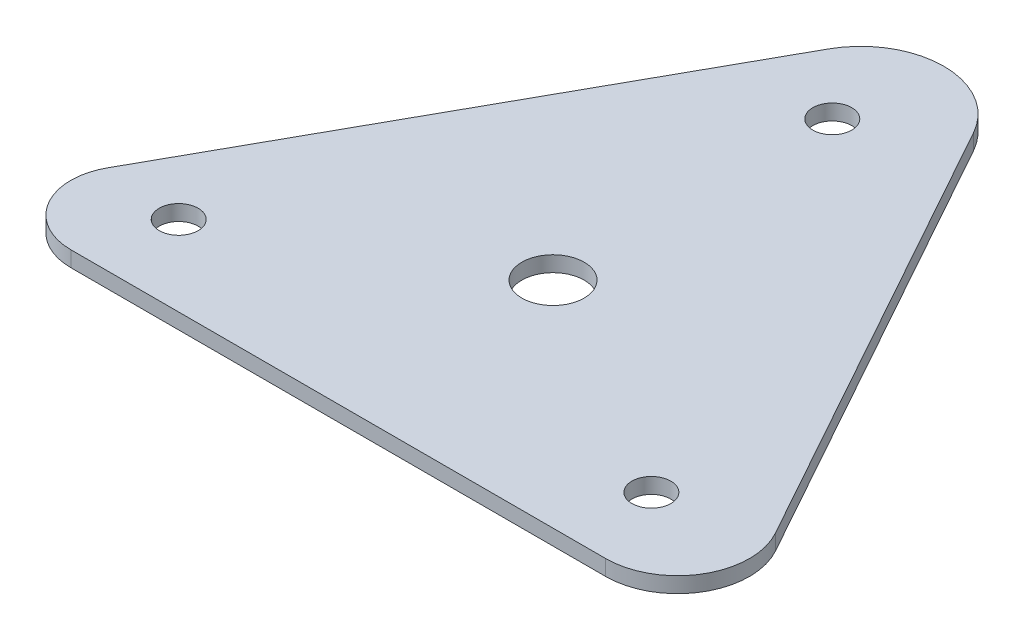
ISO-10303-21;
HEADER;
FILE_DESCRIPTION(('STEP AP214'),'2;1');
FILE_NAME('part.step','',(''),(''),'','','');
FILE_SCHEMA(('AUTOMOTIVE_DESIGN { 1 0 10303 214 1 1 1 1 }'));
ENDSEC;
DATA;
#1=APPLICATION_CONTEXT('core data for automotive mechanical design processes');
#2=APPLICATION_PROTOCOL_DEFINITION('international standard','automotive_design',2000,#1);
#3=PRODUCT_CONTEXT('',#1,'mechanical');
#4=PRODUCT('Part','Part','',(#3));
#5=PRODUCT_RELATED_PRODUCT_CATEGORY('part','',(#4));
#6=PRODUCT_DEFINITION_FORMATION('','',#4);
#7=PRODUCT_DEFINITION_CONTEXT('part definition',#1,'design');
#8=PRODUCT_DEFINITION('design','',#6,#7);
#9=PRODUCT_DEFINITION_SHAPE('','',#8);
#10=(LENGTH_UNIT() NAMED_UNIT(*) SI_UNIT(.MILLI.,.METRE.));
#11=(NAMED_UNIT(*) PLANE_ANGLE_UNIT() SI_UNIT($,.RADIAN.));
#12=(NAMED_UNIT(*) SI_UNIT($,.STERADIAN.) SOLID_ANGLE_UNIT());
#13=UNCERTAINTY_MEASURE_WITH_UNIT(LENGTH_MEASURE(1.E-05),#10,'distance_accuracy_value','');
#14=(GEOMETRIC_REPRESENTATION_CONTEXT(3) GLOBAL_UNCERTAINTY_ASSIGNED_CONTEXT((#13)) GLOBAL_UNIT_ASSIGNED_CONTEXT((#10,
#11,#12)) REPRESENTATION_CONTEXT('',''));
#15=CARTESIAN_POINT('',(0.,0.,0.));
#16=DIRECTION('',(0.,0.,1.));
#17=DIRECTION('',(1.,0.,0.));
#18=AXIS2_PLACEMENT_3D('',#15,#16,#17);
#19=CARTESIAN_POINT('',(0.,3.175,-12.2555));
#20=DIRECTION('',(0.,1.,0.));
#21=DIRECTION('',(0.,0.,1.));
#22=AXIS2_PLACEMENT_3D('',#19,#20,#21);
#23=PLANE('',#22);
#24=CARTESIAN_POINT('',(54.5591999999573,3.175,-100.779243869629));
#25=DIRECTION('',(0.,1.,0.));
#26=DIRECTION('',(0.,0.,1.));
#27=AXIS2_PLACEMENT_3D('',#24,#25,#26);
#28=CIRCLE('',#27,3.96874999999998);
#29=CARTESIAN_POINT('',(54.5591999999573,3.175,-96.8104938696286));
#30=VERTEX_POINT('',#29);
#31=EDGE_CURVE('E212',#30,#30,#28,.T.);
#32=ORIENTED_EDGE('',*,*,#31,.F.);
#33=EDGE_LOOP('',(#32));
#34=FACE_BOUND('',#33,.T.);
#35=CARTESIAN_POINT('',(5.65850908847155,3.175,-16.35798352403));
#36=DIRECTION('',(0.,1.,0.));
#37=DIRECTION('',(0.,0.,1.));
#38=AXIS2_PLACEMENT_3D('',#35,#36,#37);
#39=CIRCLE('',#38,3.96875);
#40=CARTESIAN_POINT('',(5.65850908847155,3.175,-12.38923352403));
#41=VERTEX_POINT('',#40);
#42=EDGE_CURVE('E134',#41,#41,#39,.T.);
#43=ORIENTED_EDGE('',*,*,#42,.F.);
#44=EDGE_LOOP('',(#43));
#45=FACE_BOUND('',#44,.T.);
#46=CARTESIAN_POINT('',(0.,3.175,-12.2555));
#47=DIRECTION('',(0.,1.,0.));
#48=DIRECTION('',(0.,0.,1.));
#49=AXIS2_PLACEMENT_3D('',#46,#47,#48);
#50=CIRCLE('',#49,12.2555000000001);
#51=CARTESIAN_POINT('',(-10.7131227606052,3.175,-18.2074980650374));
#52=VERTEX_POINT('',#51);
#53=CARTESIAN_POINT('',(0.,3.175,0.));
#54=VERTEX_POINT('',#53);
#55=EDGE_CURVE('E146',#52,#54,#50,.T.);
#56=ORIENTED_EDGE('',*,*,#55,.T.);
#57=DIRECTION('',(1.,0.,0.));
#58=VECTOR('',#57,1.);
#59=CARTESIAN_POINT('',(0.,3.175,0.));
#60=LINE('',#59,#58);
#61=CARTESIAN_POINT('',(109.1184,3.175,0.));
#62=VERTEX_POINT('',#61);
#63=EDGE_CURVE('E94',#54,#62,#60,.T.);
#64=ORIENTED_EDGE('',*,*,#63,.T.);
#65=CARTESIAN_POINT('',(109.1184,3.175,-14.6685));
#66=DIRECTION('',(0.,1.,0.));
#67=DIRECTION('',(0.,0.,1.));
#68=AXIS2_PLACEMENT_3D('',#65,#66,#67);
#69=CIRCLE('',#68,14.6685);
#70=CARTESIAN_POINT('',(121.940842267874,3.175,-21.7923940571169));
#71=VERTEX_POINT('',#70);
#72=EDGE_CURVE('E107',#62,#71,#69,.T.);
#73=ORIENTED_EDGE('',*,*,#72,.T.);
#74=DIRECTION('',(-0.485659341931141,0.,-0.874148158835224));
#75=VECTOR('',#74,1.);
#76=CARTESIAN_POINT('',(121.940842267874,3.175,-21.7923940571169));
#77=LINE('',#76,#75);
#78=CARTESIAN_POINT('',(71.4012856410206,3.175,-112.759573228514));
#79=VERTEX_POINT('',#78);
#80=EDGE_CURVE('E101',#71,#79,#77,.T.);
#81=ORIENTED_EDGE('',*,*,#80,.T.);
#82=CARTESIAN_POINT('',(56.6097082324124,3.175,-104.541666826972));
#83=DIRECTION('',(0.,1.,0.));
#84=DIRECTION('',(0.,0.,1.));
#85=AXIS2_PLACEMENT_3D('',#82,#83,#84);
#86=CIRCLE('',#85,16.9211331730282);
#87=CARTESIAN_POINT('',(41.8181308238042,3.175,-112.759573228514));
#88=VERTEX_POINT('',#87);
#89=EDGE_CURVE('E105',#79,#88,#86,.T.);
#90=ORIENTED_EDGE('',*,*,#89,.T.);
#91=DIRECTION('',(-0.485659341931141,0.,0.874148158835224));
#92=VECTOR('',#91,1.);
#93=CARTESIAN_POINT('',(41.8181308238042,3.175,-112.759573228514));
#94=LINE('',#93,#92);
#95=EDGE_CURVE('E57',#88,#52,#94,.T.);
#96=ORIENTED_EDGE('',*,*,#95,.T.);
#97=EDGE_LOOP('',(#56,#64,#73,#81,#90,#96));
#98=FACE_BOUND('',#97,.T.);
#99=CARTESIAN_POINT('',(102.076909088472,3.175,-16.35798352403));
#100=DIRECTION('',(0.,1.,0.));
#101=DIRECTION('',(0.,0.,1.));
#102=AXIS2_PLACEMENT_3D('',#99,#100,#101);
#103=CIRCLE('',#102,3.96874999999999);
#104=CARTESIAN_POINT('',(102.076909088472,3.175,-12.38923352403));
#105=VERTEX_POINT('',#104);
#106=EDGE_CURVE('E220',#105,#105,#103,.T.);
#107=ORIENTED_EDGE('',*,*,#106,.F.);
#108=EDGE_LOOP('',(#107));
#109=FACE_BOUND('',#108,.T.);
#110=CARTESIAN_POINT('',(54.5591999999573,3.175,-43.8121906883708));
#111=DIRECTION('',(0.,1.,0.));
#112=DIRECTION('',(0.,0.,1.));
#113=AXIS2_PLACEMENT_3D('',#110,#111,#112);
#114=CIRCLE('',#113,6.35);
#115=CARTESIAN_POINT('',(54.5591999999573,3.175,-37.4621906883708));
#116=VERTEX_POINT('',#115);
#117=EDGE_CURVE('E201',#116,#116,#114,.T.);
#118=ORIENTED_EDGE('',*,*,#117,.F.);
#119=EDGE_LOOP('',(#118));
#120=FACE_BOUND('',#119,.T.);
#121=ADVANCED_FACE('F39',(#34,#45,#98,#109,#120),#23,.T.);
#122=CARTESIAN_POINT('',(0.,0.,-12.2555));
#123=DIRECTION('',(0.,1.,0.));
#124=DIRECTION('',(0.,0.,1.));
#125=AXIS2_PLACEMENT_3D('',#122,#123,#124);
#126=PLANE('',#125);
#127=CARTESIAN_POINT('',(0.,0.,-12.2555));
#128=DIRECTION('',(0.,1.,0.));
#129=DIRECTION('',(0.,0.,1.));
#130=AXIS2_PLACEMENT_3D('',#127,#128,#129);
#131=CIRCLE('',#130,12.2555000000001);
#132=CARTESIAN_POINT('',(-10.7131227606052,0.,-18.2074980650374));
#133=VERTEX_POINT('',#132);
#134=CARTESIAN_POINT('',(0.,0.,0.));
#135=VERTEX_POINT('',#134);
#136=EDGE_CURVE('E129',#133,#135,#131,.T.);
#137=ORIENTED_EDGE('',*,*,#136,.F.);
#138=DIRECTION('',(-0.485659341931141,0.,0.874148158835224));
#139=VECTOR('',#138,1.);
#140=CARTESIAN_POINT('',(41.8181308238042,0.,-112.759573228514));
#141=LINE('',#140,#139);
#142=CARTESIAN_POINT('',(41.8181308238042,0.,-112.759573228514));
#143=VERTEX_POINT('',#142);
#144=EDGE_CURVE('E86',#143,#133,#141,.T.);
#145=ORIENTED_EDGE('',*,*,#144,.F.);
#146=CARTESIAN_POINT('',(56.6097082324124,0.,-104.541666826972));
#147=DIRECTION('',(0.,1.,0.));
#148=DIRECTION('',(0.,0.,1.));
#149=AXIS2_PLACEMENT_3D('',#146,#147,#148);
#150=CIRCLE('',#149,16.9211331730282);
#151=CARTESIAN_POINT('',(71.4012856410206,0.,-112.759573228514));
#152=VERTEX_POINT('',#151);
#153=EDGE_CURVE('E80',#152,#143,#150,.T.);
#154=ORIENTED_EDGE('',*,*,#153,.F.);
#155=DIRECTION('',(-0.485659341931141,0.,-0.874148158835224));
#156=VECTOR('',#155,1.);
#157=CARTESIAN_POINT('',(121.940842267874,0.,-21.7923940571169));
#158=LINE('',#157,#156);
#159=CARTESIAN_POINT('',(121.940842267874,0.,-21.7923940571169));
#160=VERTEX_POINT('',#159);
#161=EDGE_CURVE('E116',#160,#152,#158,.T.);
#162=ORIENTED_EDGE('',*,*,#161,.F.);
#163=CARTESIAN_POINT('',(109.1184,0.,-14.6685));
#164=DIRECTION('',(0.,1.,0.));
#165=DIRECTION('',(0.,0.,1.));
#166=AXIS2_PLACEMENT_3D('',#163,#164,#165);
#167=CIRCLE('',#166,14.6685);
#168=CARTESIAN_POINT('',(109.1184,0.,0.));
#169=VERTEX_POINT('',#168);
#170=EDGE_CURVE('E137',#169,#160,#167,.T.);
#171=ORIENTED_EDGE('',*,*,#170,.F.);
#172=DIRECTION('',(1.,0.,0.));
#173=VECTOR('',#172,1.);
#174=CARTESIAN_POINT('',(0.,0.,0.));
#175=LINE('',#174,#173);
#176=EDGE_CURVE('E133',#135,#169,#175,.T.);
#177=ORIENTED_EDGE('',*,*,#176,.F.);
#178=EDGE_LOOP('',(#137,#145,#154,#162,#171,#177));
#179=FACE_BOUND('',#178,.T.);
#180=CARTESIAN_POINT('',(5.65850908847155,0.,-16.35798352403));
#181=DIRECTION('',(0.,1.,0.));
#182=DIRECTION('',(0.,0.,1.));
#183=AXIS2_PLACEMENT_3D('',#180,#181,#182);
#184=CIRCLE('',#183,3.96875);
#185=CARTESIAN_POINT('',(5.65850908847155,0.,-12.38923352403));
#186=VERTEX_POINT('',#185);
#187=EDGE_CURVE('E224',#186,#186,#184,.T.);
#188=ORIENTED_EDGE('',*,*,#187,.T.);
#189=EDGE_LOOP('',(#188));
#190=FACE_BOUND('',#189,.T.);
#191=CARTESIAN_POINT('',(102.076909088472,0.,-16.35798352403));
#192=DIRECTION('',(0.,1.,0.));
#193=DIRECTION('',(0.,0.,1.));
#194=AXIS2_PLACEMENT_3D('',#191,#192,#193);
#195=CIRCLE('',#194,3.96874999999999);
#196=CARTESIAN_POINT('',(102.076909088472,0.,-12.38923352403));
#197=VERTEX_POINT('',#196);
#198=EDGE_CURVE('E216',#197,#197,#195,.T.);
#199=ORIENTED_EDGE('',*,*,#198,.T.);
#200=EDGE_LOOP('',(#199));
#201=FACE_BOUND('',#200,.T.);
#202=CARTESIAN_POINT('',(54.5591999999573,0.,-100.779243869629));
#203=DIRECTION('',(0.,1.,0.));
#204=DIRECTION('',(0.,0.,1.));
#205=AXIS2_PLACEMENT_3D('',#202,#203,#204);
#206=CIRCLE('',#205,3.96874999999998);
#207=CARTESIAN_POINT('',(54.5591999999573,0.,-96.8104938696286));
#208=VERTEX_POINT('',#207);
#209=EDGE_CURVE('E209',#208,#208,#206,.T.);
#210=ORIENTED_EDGE('',*,*,#209,.T.);
#211=EDGE_LOOP('',(#210));
#212=FACE_BOUND('',#211,.T.);
#213=CARTESIAN_POINT('',(54.5591999999573,0.,-43.8121906883708));
#214=DIRECTION('',(0.,1.,0.));
#215=DIRECTION('',(0.,0.,1.));
#216=AXIS2_PLACEMENT_3D('',#213,#214,#215);
#217=CIRCLE('',#216,6.35);
#218=CARTESIAN_POINT('',(54.5591999999573,0.,-37.4621906883708));
#219=VERTEX_POINT('',#218);
#220=EDGE_CURVE('E204',#219,#219,#217,.T.);
#221=ORIENTED_EDGE('',*,*,#220,.T.);
#222=EDGE_LOOP('',(#221));
#223=FACE_BOUND('',#222,.T.);
#224=ADVANCED_FACE('F159',(#179,#190,#201,#212,#223),#126,.F.);
#225=CARTESIAN_POINT('',(0.,3.175,-12.2555));
#226=DIRECTION('',(0.,-1.,0.));
#227=DIRECTION('',(0.,0.,-1.));
#228=AXIS2_PLACEMENT_3D('',#225,#226,#227);
#229=CYLINDRICAL_SURFACE('',#228,12.2555000000001);
#230=ORIENTED_EDGE('',*,*,#136,.T.);
#231=DIRECTION('',(0.,-1.,0.));
#232=VECTOR('',#231,1.);
#233=CARTESIAN_POINT('',(0.,3.175,0.));
#234=LINE('',#233,#232);
#235=EDGE_CURVE('E11',#54,#135,#234,.T.);
#236=ORIENTED_EDGE('',*,*,#235,.F.);
#237=ORIENTED_EDGE('',*,*,#55,.F.);
#238=DIRECTION('',(0.,-1.,0.));
#239=VECTOR('',#238,1.);
#240=CARTESIAN_POINT('',(-10.7131227606052,3.175,-18.2074980650374));
#241=LINE('',#240,#239);
#242=EDGE_CURVE('E125',#52,#133,#241,.T.);
#243=ORIENTED_EDGE('',*,*,#242,.T.);
#244=EDGE_LOOP('',(#230,#236,#237,#243));
#245=FACE_BOUND('',#244,.T.);
#246=ADVANCED_FACE('F41',(#245),#229,.T.);
#247=CARTESIAN_POINT('',(0.,3.175,0.));
#248=DIRECTION('',(0.,0.,-1.));
#249=DIRECTION('',(-1.,0.,0.));
#250=AXIS2_PLACEMENT_3D('',#247,#248,#249);
#251=PLANE('',#250);
#252=ORIENTED_EDGE('',*,*,#176,.T.);
#253=DIRECTION('',(0.,-1.,0.));
#254=VECTOR('',#253,1.);
#255=CARTESIAN_POINT('',(109.1184,3.175,0.));
#256=LINE('',#255,#254);
#257=EDGE_CURVE('E49',#62,#169,#256,.T.);
#258=ORIENTED_EDGE('',*,*,#257,.F.);
#259=ORIENTED_EDGE('',*,*,#63,.F.);
#260=ORIENTED_EDGE('',*,*,#235,.T.);
#261=EDGE_LOOP('',(#252,#258,#259,#260));
#262=FACE_BOUND('',#261,.T.);
#263=ADVANCED_FACE('F288',(#262),#251,.F.);
#264=CARTESIAN_POINT('',(109.1184,3.175,-14.6685));
#265=DIRECTION('',(0.,-1.,0.));
#266=DIRECTION('',(0.,0.,-1.));
#267=AXIS2_PLACEMENT_3D('',#264,#265,#266);
#268=CYLINDRICAL_SURFACE('',#267,14.6685);
#269=ORIENTED_EDGE('',*,*,#170,.T.);
#270=DIRECTION('',(0.,-1.,0.));
#271=VECTOR('',#270,1.);
#272=CARTESIAN_POINT('',(121.940842267874,3.175,-21.7923940571169));
#273=LINE('',#272,#271);
#274=EDGE_CURVE('E118',#71,#160,#273,.T.);
#275=ORIENTED_EDGE('',*,*,#274,.F.);
#276=ORIENTED_EDGE('',*,*,#72,.F.);
#277=ORIENTED_EDGE('',*,*,#257,.T.);
#278=EDGE_LOOP('',(#269,#275,#276,#277));
#279=FACE_BOUND('',#278,.T.);
#280=ADVANCED_FACE('F156',(#279),#268,.T.);
#281=CARTESIAN_POINT('',(121.940842267874,3.175,-21.7923940571169));
#282=DIRECTION('',(-0.874148158835223,0.,0.485659341931141));
#283=DIRECTION('',(0.485659341931141,0.,0.874148158835224));
#284=AXIS2_PLACEMENT_3D('',#281,#282,#283);
#285=PLANE('',#284);
#286=ORIENTED_EDGE('',*,*,#161,.T.);
#287=DIRECTION('',(0.,-1.,0.));
#288=VECTOR('',#287,1.);
#289=CARTESIAN_POINT('',(71.4012856410206,3.175,-112.759573228514));
#290=LINE('',#289,#288);
#291=EDGE_CURVE('E113',#79,#152,#290,.T.);
#292=ORIENTED_EDGE('',*,*,#291,.F.);
#293=ORIENTED_EDGE('',*,*,#80,.F.);
#294=ORIENTED_EDGE('',*,*,#274,.T.);
#295=EDGE_LOOP('',(#286,#292,#293,#294));
#296=FACE_BOUND('',#295,.T.);
#297=ADVANCED_FACE('F114',(#296),#285,.F.);
#298=CARTESIAN_POINT('',(56.6097082324124,3.175,-104.541666826972));
#299=DIRECTION('',(0.,-1.,0.));
#300=DIRECTION('',(0.,0.,-1.));
#301=AXIS2_PLACEMENT_3D('',#298,#299,#300);
#302=CYLINDRICAL_SURFACE('',#301,16.9211331730282);
#303=ORIENTED_EDGE('',*,*,#153,.T.);
#304=DIRECTION('',(0.,-1.,0.));
#305=VECTOR('',#304,1.);
#306=CARTESIAN_POINT('',(41.8181308238042,3.175,-112.759573228514));
#307=LINE('',#306,#305);
#308=EDGE_CURVE('E119',#88,#143,#307,.T.);
#309=ORIENTED_EDGE('',*,*,#308,.F.);
#310=ORIENTED_EDGE('',*,*,#89,.F.);
#311=ORIENTED_EDGE('',*,*,#291,.T.);
#312=EDGE_LOOP('',(#303,#309,#310,#311));
#313=FACE_BOUND('',#312,.T.);
#314=ADVANCED_FACE('F121',(#313),#302,.T.);
#315=CARTESIAN_POINT('',(41.8181308238042,3.175,-112.759573228514));
#316=DIRECTION('',(0.874148158835223,0.,0.485659341931141));
#317=DIRECTION('',(0.485659341931141,0.,-0.874148158835224));
#318=AXIS2_PLACEMENT_3D('',#315,#316,#317);
#319=PLANE('',#318);
#320=ORIENTED_EDGE('',*,*,#144,.T.);
#321=ORIENTED_EDGE('',*,*,#242,.F.);
#322=ORIENTED_EDGE('',*,*,#95,.F.);
#323=ORIENTED_EDGE('',*,*,#308,.T.);
#324=EDGE_LOOP('',(#320,#321,#322,#323));
#325=FACE_BOUND('',#324,.T.);
#326=ADVANCED_FACE('F164',(#325),#319,.F.);
#327=CARTESIAN_POINT('',(5.65850908847155,3.175,-16.35798352403));
#328=DIRECTION('',(0.,-1.,0.));
#329=DIRECTION('',(0.,0.,-1.));
#330=AXIS2_PLACEMENT_3D('',#327,#328,#329);
#331=CYLINDRICAL_SURFACE('',#330,3.96875);
#332=ORIENTED_EDGE('',*,*,#42,.T.);
#333=EDGE_LOOP('',(#332));
#334=FACE_BOUND('',#333,.T.);
#335=ORIENTED_EDGE('',*,*,#187,.F.);
#336=EDGE_LOOP('',(#335));
#337=FACE_BOUND('',#336,.T.);
#338=ADVANCED_FACE('F166',(#334,#337),#331,.F.);
#339=CARTESIAN_POINT('',(102.076909088472,3.175,-16.35798352403));
#340=DIRECTION('',(0.,-1.,0.));
#341=DIRECTION('',(0.,0.,-1.));
#342=AXIS2_PLACEMENT_3D('',#339,#340,#341);
#343=CYLINDRICAL_SURFACE('',#342,3.96874999999999);
#344=ORIENTED_EDGE('',*,*,#106,.T.);
#345=EDGE_LOOP('',(#344));
#346=FACE_BOUND('',#345,.T.);
#347=ORIENTED_EDGE('',*,*,#198,.F.);
#348=EDGE_LOOP('',(#347));
#349=FACE_BOUND('',#348,.T.);
#350=ADVANCED_FACE('F172',(#346,#349),#343,.F.);
#351=CARTESIAN_POINT('',(54.5591999999573,3.175,-100.779243869629));
#352=DIRECTION('',(0.,-1.,0.));
#353=DIRECTION('',(0.,0.,-1.));
#354=AXIS2_PLACEMENT_3D('',#351,#352,#353);
#355=CYLINDRICAL_SURFACE('',#354,3.96874999999998);
#356=ORIENTED_EDGE('',*,*,#31,.T.);
#357=EDGE_LOOP('',(#356));
#358=FACE_BOUND('',#357,.T.);
#359=ORIENTED_EDGE('',*,*,#209,.F.);
#360=EDGE_LOOP('',(#359));
#361=FACE_BOUND('',#360,.T.);
#362=ADVANCED_FACE('F188',(#358,#361),#355,.F.);
#363=CARTESIAN_POINT('',(54.5591999999573,3.175,-43.8121906883708));
#364=DIRECTION('',(0.,-1.,0.));
#365=DIRECTION('',(0.,0.,-1.));
#366=AXIS2_PLACEMENT_3D('',#363,#364,#365);
#367=CYLINDRICAL_SURFACE('',#366,6.35);
#368=ORIENTED_EDGE('',*,*,#117,.T.);
#369=EDGE_LOOP('',(#368));
#370=FACE_BOUND('',#369,.T.);
#371=ORIENTED_EDGE('',*,*,#220,.F.);
#372=EDGE_LOOP('',(#371));
#373=FACE_BOUND('',#372,.T.);
#374=ADVANCED_FACE('F192',(#370,#373),#367,.F.);
#375=CLOSED_SHELL('',(#121,#224,#246,#263,#280,#297,#314,#326,#338,#350,#362,#374));
#376=MANIFOLD_SOLID_BREP('B2',#375);
#377=ADVANCED_BREP_SHAPE_REPRESENTATION('',(#18,#376),#14);
#378=SHAPE_DEFINITION_REPRESENTATION(#9,#377);
ENDSEC;
END-ISO-10303-21;
